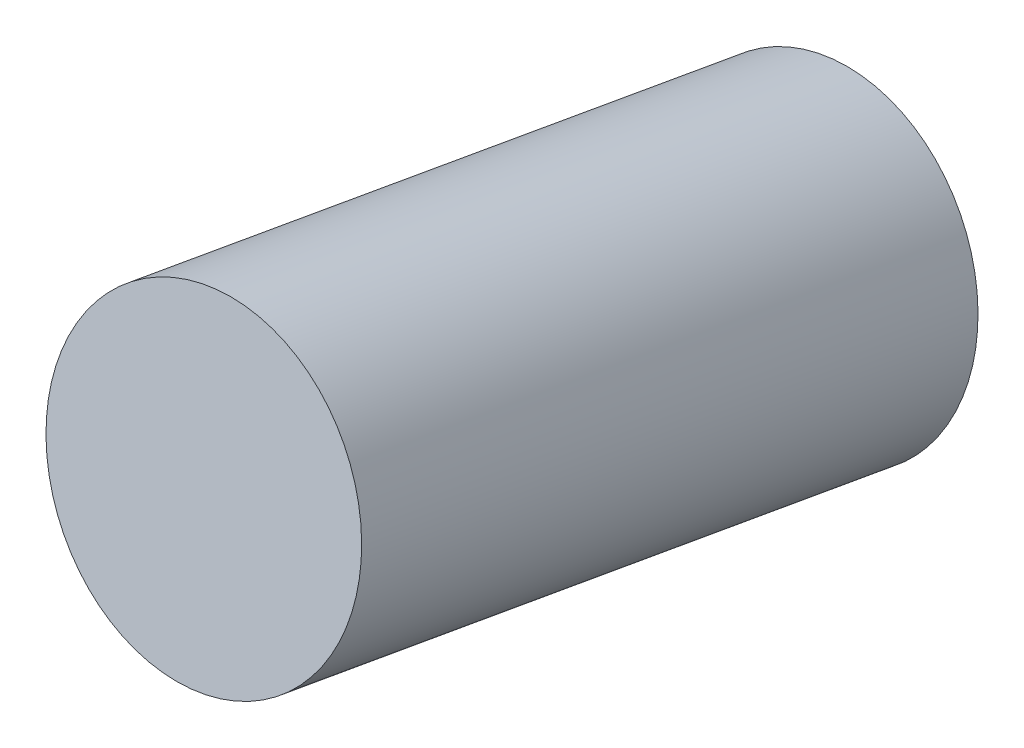
ISO-10303-21;
HEADER;
FILE_DESCRIPTION(('STEP AP214'),'2;1');
FILE_NAME('part.step','',(''),(''),'','','');
FILE_SCHEMA(('AUTOMOTIVE_DESIGN { 1 0 10303 214 1 1 1 1 }'));
ENDSEC;
DATA;
#1=APPLICATION_CONTEXT('core data for automotive mechanical design processes');
#2=APPLICATION_PROTOCOL_DEFINITION('international standard','automotive_design',2000,#1);
#3=PRODUCT_CONTEXT('',#1,'mechanical');
#4=PRODUCT('Part','Part','',(#3));
#5=PRODUCT_RELATED_PRODUCT_CATEGORY('part','',(#4));
#6=PRODUCT_DEFINITION_FORMATION('','',#4);
#7=PRODUCT_DEFINITION_CONTEXT('part definition',#1,'design');
#8=PRODUCT_DEFINITION('design','',#6,#7);
#9=PRODUCT_DEFINITION_SHAPE('','',#8);
#10=(LENGTH_UNIT() NAMED_UNIT(*) SI_UNIT(.MILLI.,.METRE.));
#11=(NAMED_UNIT(*) PLANE_ANGLE_UNIT() SI_UNIT($,.RADIAN.));
#12=(NAMED_UNIT(*) SI_UNIT($,.STERADIAN.) SOLID_ANGLE_UNIT());
#13=UNCERTAINTY_MEASURE_WITH_UNIT(LENGTH_MEASURE(1.E-05),#10,'distance_accuracy_value','');
#14=(GEOMETRIC_REPRESENTATION_CONTEXT(3) GLOBAL_UNCERTAINTY_ASSIGNED_CONTEXT((#13)) GLOBAL_UNIT_ASSIGNED_CONTEXT((#10,
#11,#12)) REPRESENTATION_CONTEXT('',''));
#15=CARTESIAN_POINT('',(0.,0.,0.));
#16=DIRECTION('',(0.,0.,1.));
#17=DIRECTION('',(1.,0.,0.));
#18=AXIS2_PLACEMENT_3D('',#15,#16,#17);
#19=CARTESIAN_POINT('',(0.,-11.1156843038204,4.48352085995661));
#20=DIRECTION('',(0.,-0.173648177666927,-0.984807753012209));
#21=DIRECTION('',(0.,-0.984807753012209,0.173648177666927));
#22=AXIS2_PLACEMENT_3D('',#19,#20,#21);
#23=PLANE('',#22);
#24=CARTESIAN_POINT('',(0.,-11.1156843038204,4.48352085995661));
#25=DIRECTION('',(0.,0.173648177666927,0.984807753012209));
#26=DIRECTION('',(0.,0.984807753012209,-0.173648177666927));
#27=AXIS2_PLACEMENT_3D('',#24,#25,#26);
#28=CIRCLE('',#27,1.93220030269667);
#29=CARTESIAN_POINT('',(0.,-9.21283846535218,4.14799779850585));
#30=VERTEX_POINT('',#29);
#31=EDGE_CURVE('E10',#30,#30,#28,.T.);
#32=ORIENTED_EDGE('',*,*,#31,.T.);
#33=EDGE_LOOP('',(#32));
#34=FACE_BOUND('',#33,.T.);
#35=ADVANCED_FACE('F15',(#34),#23,.F.);
#36=CARTESIAN_POINT('',(0.,-10.9265332134386,5.55625000000001));
#37=DIRECTION('',(0.,0.173648177666927,0.984807753012209));
#38=DIRECTION('',(0.,0.984807753012209,-0.173648177666927));
#39=AXIS2_PLACEMENT_3D('',#36,#37,#38);
#40=CYLINDRICAL_SURFACE('',#39,1.93220030269667);
#41=ORIENTED_EDGE('',*,*,#31,.F.);
#42=EDGE_LOOP('',(#41));
#43=FACE_BOUND('',#42,.T.);
#44=CARTESIAN_POINT('',(0.,-12.4660881637494,-3.175));
#45=DIRECTION('',(0.,0.173648177666927,0.984807753012209));
#46=DIRECTION('',(0.,0.984807753012209,-0.173648177666927));
#47=AXIS2_PLACEMENT_3D('',#44,#45,#46);
#48=CIRCLE('',#47,1.93220030269668);
#49=CARTESIAN_POINT('',(0.,-10.5632423252812,-3.51052306145076));
#50=VERTEX_POINT('',#49);
#51=EDGE_CURVE('E19',#50,#50,#48,.T.);
#52=ORIENTED_EDGE('',*,*,#51,.T.);
#53=EDGE_LOOP('',(#52));
#54=FACE_BOUND('',#53,.T.);
#55=ADVANCED_FACE('F28',(#43,#54),#40,.T.);
#56=CARTESIAN_POINT('',(-1.00337787971243E-13,-14.3689340022176,-2.83947693854923));
#57=DIRECTION('',(0.,0.173648177666927,0.984807753012209));
#58=DIRECTION('',(0.,0.984807753012209,-0.173648177666927));
#59=AXIS2_PLACEMENT_3D('',#56,#57,#58);
#60=PLANE('',#59);
#61=ORIENTED_EDGE('',*,*,#51,.F.);
#62=EDGE_LOOP('',(#61));
#63=FACE_BOUND('',#62,.T.);
#64=ADVANCED_FACE('F17',(#63),#60,.F.);
#65=CLOSED_SHELL('',(#35,#55,#64));
#66=MANIFOLD_SOLID_BREP('B1',#65);
#67=ADVANCED_BREP_SHAPE_REPRESENTATION('',(#18,#66),#14);
#68=SHAPE_DEFINITION_REPRESENTATION(#9,#67);
ENDSEC;
END-ISO-10303-21;
